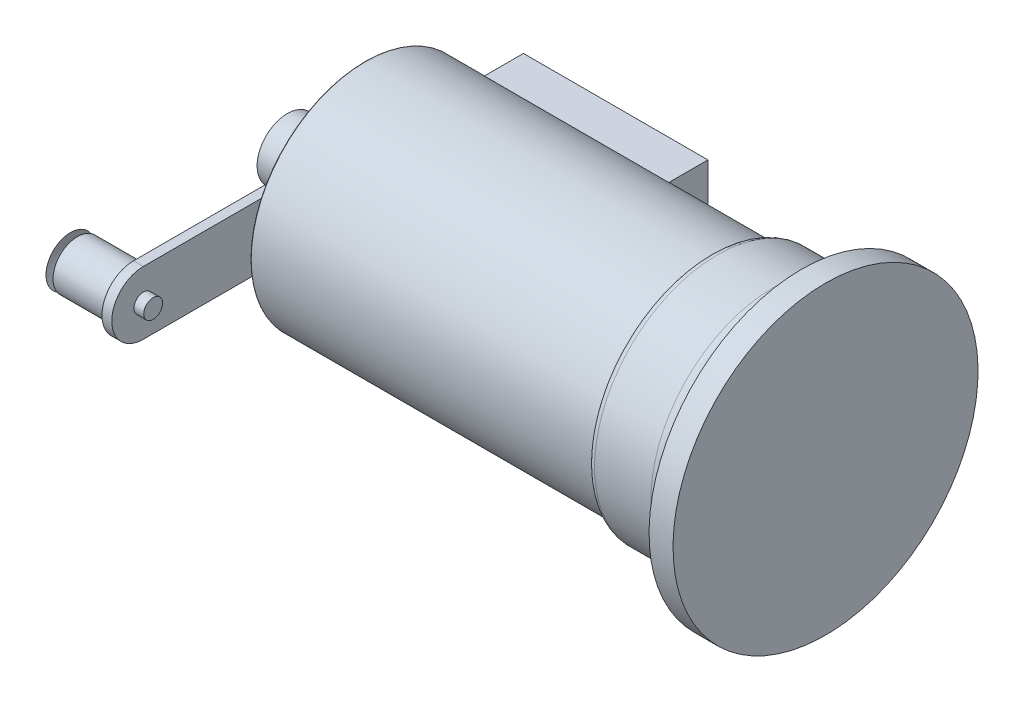
ISO-10303-21;
HEADER;
FILE_DESCRIPTION(('STEP AP214'),'2;1');
FILE_NAME('part.step','',(''),(''),'','','');
FILE_SCHEMA(('AUTOMOTIVE_DESIGN { 1 0 10303 214 1 1 1 1 }'));
ENDSEC;
DATA;
#1=APPLICATION_CONTEXT('core data for automotive mechanical design processes');
#2=APPLICATION_PROTOCOL_DEFINITION('international standard','automotive_design',2000,#1);
#3=PRODUCT_CONTEXT('',#1,'mechanical');
#4=PRODUCT('Part','Part','',(#3));
#5=PRODUCT_RELATED_PRODUCT_CATEGORY('part','',(#4));
#6=PRODUCT_DEFINITION_FORMATION('','',#4);
#7=PRODUCT_DEFINITION_CONTEXT('part definition',#1,'design');
#8=PRODUCT_DEFINITION('design','',#6,#7);
#9=PRODUCT_DEFINITION_SHAPE('','',#8);
#10=(LENGTH_UNIT() NAMED_UNIT(*) SI_UNIT(.MILLI.,.METRE.));
#11=(NAMED_UNIT(*) PLANE_ANGLE_UNIT() SI_UNIT($,.RADIAN.));
#12=(NAMED_UNIT(*) SI_UNIT($,.STERADIAN.) SOLID_ANGLE_UNIT());
#13=UNCERTAINTY_MEASURE_WITH_UNIT(LENGTH_MEASURE(1.E-05),#10,'distance_accuracy_value','');
#14=(GEOMETRIC_REPRESENTATION_CONTEXT(3) GLOBAL_UNCERTAINTY_ASSIGNED_CONTEXT((#13)) GLOBAL_UNIT_ASSIGNED_CONTEXT((#10,
#11,#12)) REPRESENTATION_CONTEXT('',''));
#15=CARTESIAN_POINT('',(0.,0.,0.));
#16=DIRECTION('',(0.,0.,1.));
#17=DIRECTION('',(1.,0.,0.));
#18=AXIS2_PLACEMENT_3D('',#15,#16,#17);
#19=CARTESIAN_POINT('',(-12.9159,-0.0269671132041851,37.2598205131048));
#20=DIRECTION('',(1.,0.,0.));
#21=DIRECTION('',(0.,-1.,0.));
#22=AXIS2_PLACEMENT_3D('',#19,#20,#21);
#23=CONICAL_SURFACE('',#22,4.43287682860842,1.1693705988362);
#24=CARTESIAN_POINT('',(-14.7975445771034,-0.0269671132041851,37.2598205131048));
#25=VERTEX_POINT('',#24);
#26=VERTEX_LOOP('',#25);
#27=FACE_BOUND('',#26,.T.);
#28=CARTESIAN_POINT('',(-12.9159,-0.0269671132041851,37.2598205131048));
#29=DIRECTION('',(-1.,0.,0.));
#30=DIRECTION('',(0.,-1.,0.));
#31=AXIS2_PLACEMENT_3D('',#28,#29,#30);
#32=CIRCLE('',#31,4.43287682860842);
#33=CARTESIAN_POINT('',(-12.9159,-4.45984394181261,37.2598205131048));
#34=VERTEX_POINT('',#33);
#35=EDGE_CURVE('E12',#34,#34,#32,.T.);
#36=ORIENTED_EDGE('',*,*,#35,.T.);
#37=EDGE_LOOP('',(#36));
#38=FACE_BOUND('',#37,.T.);
#39=ADVANCED_FACE('F44',(#27,#38),#23,.T.);
#40=OPEN_SHELL('',(#39));
#41=SHELL_BASED_SURFACE_MODEL('B2',(#40));
#42=CARTESIAN_POINT('',(2.0701,-0.0269671132041848,37.2598205131048));
#43=DIRECTION('',(-1.,0.,0.));
#44=DIRECTION('',(0.,-1.,0.));
#45=AXIS2_PLACEMENT_3D('',#42,#43,#44);
#46=CYLINDRICAL_SURFACE('',#45,1.70950383668605);
#47=CARTESIAN_POINT('',(2.0701,-0.0269671132041848,37.2598205131048));
#48=DIRECTION('',(-1.,0.,0.));
#49=DIRECTION('',(0.,-1.,0.));
#50=AXIS2_PLACEMENT_3D('',#47,#48,#49);
#51=CIRCLE('',#50,1.70950383668605);
#52=CARTESIAN_POINT('',(2.0701,-1.73647094989023,37.2598205131048));
#53=VERTEX_POINT('',#52);
#54=EDGE_CURVE('E43',#53,#53,#51,.T.);
#55=ORIENTED_EDGE('',*,*,#54,.T.);
#56=EDGE_LOOP('',(#55));
#57=FACE_BOUND('',#56,.T.);
#58=CARTESIAN_POINT('',(-12.9159,-0.0269671132041851,37.2598205131048));
#59=DIRECTION('',(-1.,0.,0.));
#60=DIRECTION('',(0.,-1.,0.));
#61=AXIS2_PLACEMENT_3D('',#58,#59,#60);
#62=CIRCLE('',#61,1.70950383668605);
#63=CARTESIAN_POINT('',(-12.9159,-1.73647094989023,37.2598205131048));
#64=VERTEX_POINT('',#63);
#65=EDGE_CURVE('E77',#64,#64,#62,.T.);
#66=ORIENTED_EDGE('',*,*,#65,.F.);
#67=EDGE_LOOP('',(#66));
#68=FACE_BOUND('',#67,.T.);
#69=ADVANCED_FACE('F71',(#57,#68),#46,.T.);
#70=CARTESIAN_POINT('',(2.0701,-0.0269671132041848,37.2598205131048));
#71=DIRECTION('',(-1.,0.,0.));
#72=DIRECTION('',(0.,-1.,0.));
#73=AXIS2_PLACEMENT_3D('',#70,#71,#72);
#74=PLANE('',#73);
#75=ORIENTED_EDGE('',*,*,#54,.F.);
#76=EDGE_LOOP('',(#75));
#77=FACE_BOUND('',#76,.T.);
#78=ADVANCED_FACE('F86',(#77),#74,.F.);
#79=CARTESIAN_POINT('',(-12.9159,-0.0269671132041851,37.2598205131048));
#80=DIRECTION('',(-1.,0.,0.));
#81=DIRECTION('',(0.,-1.,0.));
#82=AXIS2_PLACEMENT_3D('',#79,#80,#81);
#83=PLANE('',#82);
#84=ORIENTED_EDGE('',*,*,#65,.T.);
#85=EDGE_LOOP('',(#84));
#86=FACE_BOUND('',#85,.T.);
#87=ADVANCED_FACE('F83',(#86),#83,.T.);
#88=CLOSED_SHELL('',(#69,#78,#87));
#89=MANIFOLD_SOLID_BREP('B6',#88);
#90=CARTESIAN_POINT('',(-11.6459,-0.0269671132041851,37.2598205131048));
#91=DIRECTION('',(1.,0.,0.));
#92=DIRECTION('',(0.,1.,0.));
#93=AXIS2_PLACEMENT_3D('',#90,#91,#92);
#94=CYLINDRICAL_SURFACE('',#93,4.43287682860842);
#95=CARTESIAN_POINT('',(-11.6459,-0.0269671132041851,37.2598205131048));
#96=DIRECTION('',(-1.,0.,0.));
#97=DIRECTION('',(0.,-1.,0.));
#98=AXIS2_PLACEMENT_3D('',#95,#96,#97);
#99=CIRCLE('',#98,4.43287682860842);
#100=CARTESIAN_POINT('',(-11.6459,-4.45984394181261,37.2598205131048));
#101=VERTEX_POINT('',#100);
#102=EDGE_CURVE('E70',#101,#101,#99,.T.);
#103=ORIENTED_EDGE('',*,*,#102,.F.);
#104=EDGE_LOOP('',(#103));
#105=FACE_BOUND('',#104,.T.);
#106=CARTESIAN_POINT('',(0.292100000000004,-0.0269671132041849,37.2598205131048));
#107=DIRECTION('',(-1.,0.,0.));
#108=DIRECTION('',(0.,-1.,0.));
#109=AXIS2_PLACEMENT_3D('',#106,#107,#108);
#110=CIRCLE('',#109,4.43287682860842);
#111=CARTESIAN_POINT('',(0.292100000000004,-4.45984394181261,37.2598205131048));
#112=VERTEX_POINT('',#111);
#113=EDGE_CURVE('E124',#112,#112,#110,.T.);
#114=ORIENTED_EDGE('',*,*,#113,.T.);
#115=EDGE_LOOP('',(#114));
#116=FACE_BOUND('',#115,.T.);
#117=ADVANCED_FACE('F122',(#105,#116),#94,.T.);
#118=CARTESIAN_POINT('',(-11.6459,-0.0269671132041851,37.2598205131048));
#119=DIRECTION('',(-1.,0.,0.));
#120=DIRECTION('',(0.,-1.,0.));
#121=AXIS2_PLACEMENT_3D('',#118,#119,#120);
#122=PLANE('',#121);
#123=ORIENTED_EDGE('',*,*,#102,.T.);
#124=EDGE_LOOP('',(#123));
#125=FACE_BOUND('',#124,.T.);
#126=ADVANCED_FACE('F136',(#125),#122,.T.);
#127=OPEN_SHELL('',(#117,#126));
#128=SHELL_BASED_SURFACE_MODEL('B38',(#127));
#129=CARTESIAN_POINT('',(0.292100000000004,-0.0269671132041892,-0.316599909176667));
#130=DIRECTION('',(-1.,0.,0.));
#131=DIRECTION('',(0.,-1.,0.));
#132=AXIS2_PLACEMENT_3D('',#129,#130,#131);
#133=PLANE('',#132);
#134=DIRECTION('',(0.,0.,-1.));
#135=VECTOR('',#134,1.);
#136=CARTESIAN_POINT('',(0.292100000000004,5.68803288679581,-1.98080117287673));
#137=LINE('',#136,#135);
#138=CARTESIAN_POINT('',(0.292100000000004,5.68803288679581,37.2598205131048));
#139=VERTEX_POINT('',#138);
#140=CARTESIAN_POINT('',(0.292100000000004,5.68803288679581,-1.98080117287673));
#141=VERTEX_POINT('',#140);
#142=EDGE_CURVE('E173',#139,#141,#137,.T.);
#143=ORIENTED_EDGE('',*,*,#142,.T.);
#144=CARTESIAN_POINT('',(0.292100000000004,-0.0269671132041892,-0.316599909176667));
#145=DIRECTION('',(-1.,0.,0.));
#146=DIRECTION('',(0.,1.,0.));
#147=AXIS2_PLACEMENT_3D('',#144,#145,#146);
#148=CIRCLE('',#147,5.95237690726157);
#149=CARTESIAN_POINT('',(0.292100000000004,-5.74196711320419,-1.98080117287673));
#150=VERTEX_POINT('',#149);
#151=EDGE_CURVE('E184',#141,#150,#148,.T.);
#152=ORIENTED_EDGE('',*,*,#151,.T.);
#153=DIRECTION('',(0.,0.,1.));
#154=VECTOR('',#153,1.);
#155=CARTESIAN_POINT('',(0.292100000000004,-5.74196711320419,-1.98080117287673));
#156=LINE('',#155,#154);
#157=CARTESIAN_POINT('',(0.292100000000004,-5.74196711320418,37.2598205131048));
#158=VERTEX_POINT('',#157);
#159=EDGE_CURVE('E169',#150,#158,#156,.T.);
#160=ORIENTED_EDGE('',*,*,#159,.T.);
#161=CARTESIAN_POINT('',(0.292100000000004,-0.0269671132041849,37.2598205131048));
#162=DIRECTION('',(-1.,0.,0.));
#163=DIRECTION('',(0.,1.,0.));
#164=AXIS2_PLACEMENT_3D('',#161,#162,#163);
#165=CIRCLE('',#164,5.71499999999999);
#166=EDGE_CURVE('E120',#158,#139,#165,.T.);
#167=ORIENTED_EDGE('',*,*,#166,.T.);
#168=EDGE_LOOP('',(#143,#152,#160,#167));
#169=FACE_BOUND('',#168,.T.);
#170=ADVANCED_FACE('F164',(#169),#133,.T.);
#171=OPEN_SHELL('',(#170));
#172=SHELL_BASED_SURFACE_MODEL('B65',(#171));
#173=CARTESIAN_POINT('',(-1.4859,-0.0269671132041892,-0.316599909176667));
#174=DIRECTION('',(-1.,0.,0.));
#175=DIRECTION('',(0.,-1.,0.));
#176=AXIS2_PLACEMENT_3D('',#173,#174,#175);
#177=PLANE('',#176);
#178=CARTESIAN_POINT('',(-1.4859,-0.0269671132041892,-0.316599909176667));
#179=DIRECTION('',(-1.,0.,0.));
#180=DIRECTION('',(0.,1.,0.));
#181=AXIS2_PLACEMENT_3D('',#178,#179,#180);
#182=CIRCLE('',#181,5.95237690726157);
#183=CARTESIAN_POINT('',(-1.4859,5.68803288679581,-1.98080117287673));
#184=VERTEX_POINT('',#183);
#185=CARTESIAN_POINT('',(-1.4859,-5.74196711320419,-1.98080117287673));
#186=VERTEX_POINT('',#185);
#187=EDGE_CURVE('E227',#184,#186,#182,.T.);
#188=ORIENTED_EDGE('',*,*,#187,.T.);
#189=DIRECTION('',(0.,0.,1.));
#190=VECTOR('',#189,1.);
#191=CARTESIAN_POINT('',(-1.4859,-5.74196711320419,-1.98080117287673));
#192=LINE('',#191,#190);
#193=CARTESIAN_POINT('',(-1.4859,-5.74196711320418,37.2598205131048));
#194=VERTEX_POINT('',#193);
#195=EDGE_CURVE('E238',#186,#194,#192,.T.);
#196=ORIENTED_EDGE('',*,*,#195,.T.);
#197=CARTESIAN_POINT('',(-1.4859,-0.0269671132041849,37.2598205131048));
#198=DIRECTION('',(-1.,0.,0.));
#199=DIRECTION('',(0.,1.,0.));
#200=AXIS2_PLACEMENT_3D('',#197,#198,#199);
#201=CIRCLE('',#200,5.71499999999999);
#202=CARTESIAN_POINT('',(-1.4859,5.68803288679581,37.2598205131048));
#203=VERTEX_POINT('',#202);
#204=EDGE_CURVE('E223',#194,#203,#201,.T.);
#205=ORIENTED_EDGE('',*,*,#204,.T.);
#206=DIRECTION('',(0.,0.,-1.));
#207=VECTOR('',#206,1.);
#208=CARTESIAN_POINT('',(-1.4859,5.68803288679581,-1.98080117287673));
#209=LINE('',#208,#207);
#210=EDGE_CURVE('E162',#203,#184,#209,.T.);
#211=ORIENTED_EDGE('',*,*,#210,.T.);
#212=EDGE_LOOP('',(#188,#196,#205,#211));
#213=FACE_BOUND('',#212,.T.);
#214=ADVANCED_FACE('F218',(#213),#177,.T.);
#215=OPEN_SHELL('',(#214));
#216=SHELL_BASED_SURFACE_MODEL('B114',(#215));
#217=CARTESIAN_POINT('',(0.292100000000004,-0.0269671132041892,-0.316599909176667));
#218=DIRECTION('',(-1.,0.,0.));
#219=DIRECTION('',(0.,-1.,0.));
#220=AXIS2_PLACEMENT_3D('',#217,#218,#219);
#221=CYLINDRICAL_SURFACE('',#220,5.95237690726157);
#222=CARTESIAN_POINT('',(-1.4859,-0.0269671132041892,-0.316599909176667));
#223=DIRECTION('',(-1.,0.,0.));
#224=DIRECTION('',(0.,1.,0.));
#225=AXIS2_PLACEMENT_3D('',#222,#223,#224);
#226=CIRCLE('',#225,5.95237690726157);
#227=CARTESIAN_POINT('',(-1.4859,5.68803288679581,-1.98080117287673));
#228=VERTEX_POINT('',#227);
#229=CARTESIAN_POINT('',(-1.4859,-5.74196711320419,-1.98080117287673));
#230=VERTEX_POINT('',#229);
#231=EDGE_CURVE('E280',#228,#230,#226,.T.);
#232=ORIENTED_EDGE('',*,*,#231,.F.);
#233=DIRECTION('',(-1.,0.,0.));
#234=VECTOR('',#233,1.);
#235=CARTESIAN_POINT('',(0.292100000000004,5.68803288679581,-1.98080117287673));
#236=LINE('',#235,#234);
#237=CARTESIAN_POINT('',(0.292100000000004,5.68803288679581,-1.98080117287673));
#238=VERTEX_POINT('',#237);
#239=EDGE_CURVE('E288',#238,#228,#236,.T.);
#240=ORIENTED_EDGE('',*,*,#239,.F.);
#241=CARTESIAN_POINT('',(0.292100000000004,-0.0269671132041892,-0.316599909176667));
#242=DIRECTION('',(-1.,0.,0.));
#243=DIRECTION('',(0.,1.,0.));
#244=AXIS2_PLACEMENT_3D('',#241,#242,#243);
#245=CIRCLE('',#244,5.95237690726157);
#246=CARTESIAN_POINT('',(0.292100000000004,-5.74196711320419,-1.98080117287673));
#247=VERTEX_POINT('',#246);
#248=EDGE_CURVE('E216',#238,#247,#245,.T.);
#249=ORIENTED_EDGE('',*,*,#248,.T.);
#250=DIRECTION('',(-1.,0.,0.));
#251=VECTOR('',#250,1.);
#252=CARTESIAN_POINT('',(0.292100000000004,-5.74196711320419,-1.98080117287673));
#253=LINE('',#252,#251);
#254=EDGE_CURVE('E274',#247,#230,#253,.T.);
#255=ORIENTED_EDGE('',*,*,#254,.T.);
#256=EDGE_LOOP('',(#232,#240,#249,#255));
#257=FACE_BOUND('',#256,.T.);
#258=ADVANCED_FACE('F272',(#257),#221,.T.);
#259=CARTESIAN_POINT('',(0.292100000000004,-5.74196711320419,-1.98080117287673));
#260=DIRECTION('',(0.,-1.,0.));
#261=DIRECTION('',(0.,0.,-1.));
#262=AXIS2_PLACEMENT_3D('',#259,#260,#261);
#263=PLANE('',#262);
#264=DIRECTION('',(0.,0.,1.));
#265=VECTOR('',#264,1.);
#266=CARTESIAN_POINT('',(-1.4859,-5.74196711320419,-1.98080117287673));
#267=LINE('',#266,#265);
#268=CARTESIAN_POINT('',(-1.4859,-5.74196711320418,37.2598205131048));
#269=VERTEX_POINT('',#268);
#270=EDGE_CURVE('E325',#230,#269,#267,.T.);
#271=ORIENTED_EDGE('',*,*,#270,.F.);
#272=ORIENTED_EDGE('',*,*,#254,.F.);
#273=DIRECTION('',(0.,0.,1.));
#274=VECTOR('',#273,1.);
#275=CARTESIAN_POINT('',(0.292100000000004,-5.74196711320419,-1.98080117287673));
#276=LINE('',#275,#274);
#277=CARTESIAN_POINT('',(0.292100000000004,-5.74196711320418,37.2598205131048));
#278=VERTEX_POINT('',#277);
#279=EDGE_CURVE('E327',#247,#278,#276,.T.);
#280=ORIENTED_EDGE('',*,*,#279,.T.);
#281=DIRECTION('',(-1.,0.,0.));
#282=VECTOR('',#281,1.);
#283=CARTESIAN_POINT('',(0.292100000000004,-5.74196711320418,37.2598205131048));
#284=LINE('',#283,#282);
#285=EDGE_CURVE('E317',#278,#269,#284,.T.);
#286=ORIENTED_EDGE('',*,*,#285,.T.);
#287=EDGE_LOOP('',(#271,#272,#280,#286));
#288=FACE_BOUND('',#287,.T.);
#289=ADVANCED_FACE('F328',(#288),#263,.T.);
#290=CARTESIAN_POINT('',(0.292100000000004,-0.0269671132041849,37.2598205131048));
#291=DIRECTION('',(-1.,0.,0.));
#292=DIRECTION('',(0.,-1.,0.));
#293=AXIS2_PLACEMENT_3D('',#290,#291,#292);
#294=CYLINDRICAL_SURFACE('',#293,5.71499999999999);
#295=CARTESIAN_POINT('',(-1.4859,-0.0269671132041849,37.2598205131048));
#296=DIRECTION('',(-1.,0.,0.));
#297=DIRECTION('',(0.,1.,0.));
#298=AXIS2_PLACEMENT_3D('',#295,#296,#297);
#299=CIRCLE('',#298,5.71499999999999);
#300=CARTESIAN_POINT('',(-1.4859,5.68803288679581,37.2598205131048));
#301=VERTEX_POINT('',#300);
#302=EDGE_CURVE('E322',#269,#301,#299,.T.);
#303=ORIENTED_EDGE('',*,*,#302,.F.);
#304=ORIENTED_EDGE('',*,*,#285,.F.);
#305=CARTESIAN_POINT('',(0.292100000000004,-0.0269671132041849,37.2598205131048));
#306=DIRECTION('',(-1.,0.,0.));
#307=DIRECTION('',(0.,1.,0.));
#308=AXIS2_PLACEMENT_3D('',#305,#306,#307);
#309=CIRCLE('',#308,5.71499999999999);
#310=CARTESIAN_POINT('',(0.292100000000004,5.68803288679581,37.2598205131048));
#311=VERTEX_POINT('',#310);
#312=EDGE_CURVE('E320',#278,#311,#309,.T.);
#313=ORIENTED_EDGE('',*,*,#312,.T.);
#314=DIRECTION('',(-1.,0.,0.));
#315=VECTOR('',#314,1.);
#316=CARTESIAN_POINT('',(0.292100000000004,5.68803288679581,37.2598205131048));
#317=LINE('',#316,#315);
#318=EDGE_CURVE('E305',#311,#301,#317,.T.);
#319=ORIENTED_EDGE('',*,*,#318,.T.);
#320=EDGE_LOOP('',(#303,#304,#313,#319));
#321=FACE_BOUND('',#320,.T.);
#322=ADVANCED_FACE('F319',(#321),#294,.T.);
#323=CARTESIAN_POINT('',(0.292100000000004,5.68803288679581,-1.98080117287673));
#324=DIRECTION('',(0.,1.,0.));
#325=DIRECTION('',(-1.,0.,0.));
#326=AXIS2_PLACEMENT_3D('',#323,#324,#325);
#327=PLANE('',#326);
#328=DIRECTION('',(0.,0.,-1.));
#329=VECTOR('',#328,1.);
#330=CARTESIAN_POINT('',(-1.4859,5.68803288679581,-1.98080117287673));
#331=LINE('',#330,#329);
#332=EDGE_CURVE('E344',#301,#228,#331,.T.);
#333=ORIENTED_EDGE('',*,*,#332,.F.);
#334=ORIENTED_EDGE('',*,*,#318,.F.);
#335=DIRECTION('',(0.,0.,-1.));
#336=VECTOR('',#335,1.);
#337=CARTESIAN_POINT('',(0.292100000000004,5.68803288679581,-1.98080117287673));
#338=LINE('',#337,#336);
#339=EDGE_CURVE('E338',#311,#238,#338,.T.);
#340=ORIENTED_EDGE('',*,*,#339,.T.);
#341=ORIENTED_EDGE('',*,*,#239,.T.);
#342=EDGE_LOOP('',(#333,#334,#340,#341));
#343=FACE_BOUND('',#342,.T.);
#344=ADVANCED_FACE('F358',(#343),#327,.T.);
#345=OPEN_SHELL('',(#258,#289,#322,#344));
#346=SHELL_BASED_SURFACE_MODEL('B156',(#345));
#347=CARTESIAN_POINT('',(0.,0.,-20.73275));
#348=DIRECTION('',(0.,0.,1.));
#349=DIRECTION('',(1.,0.,0.));
#350=AXIS2_PLACEMENT_3D('',#347,#348,#349);
#351=PLANE('',#350);
#352=DIRECTION('',(-1.,0.,0.));
#353=VECTOR('',#352,1.);
#354=CARTESIAN_POINT('',(44.6077146277967,15.5702,-20.73275));
#355=LINE('',#354,#353);
#356=CARTESIAN_POINT('',(44.6077146277967,15.5702,-20.73275));
#357=VERTEX_POINT('',#356);
#358=CARTESIAN_POINT('',(11.1813146277967,15.5702,-20.73275));
#359=VERTEX_POINT('',#358);
#360=EDGE_CURVE('E417',#357,#359,#355,.T.);
#361=ORIENTED_EDGE('',*,*,#360,.T.);
#362=DIRECTION('',(0.,-1.,0.));
#363=VECTOR('',#362,1.);
#364=CARTESIAN_POINT('',(11.1813146277967,15.5702,-20.73275));
#365=LINE('',#364,#363);
#366=CARTESIAN_POINT('',(11.1813146277967,-15.5702,-20.73275));
#367=VERTEX_POINT('',#366);
#368=EDGE_CURVE('E428',#359,#367,#365,.T.);
#369=ORIENTED_EDGE('',*,*,#368,.T.);
#370=DIRECTION('',(1.,0.,0.));
#371=VECTOR('',#370,1.);
#372=CARTESIAN_POINT('',(11.1813146277967,-15.5702,-20.73275));
#373=LINE('',#372,#371);
#374=CARTESIAN_POINT('',(44.6077146277967,-15.5702,-20.73275));
#375=VERTEX_POINT('',#374);
#376=EDGE_CURVE('E413',#367,#375,#373,.T.);
#377=ORIENTED_EDGE('',*,*,#376,.T.);
#378=DIRECTION('',(0.,1.,0.));
#379=VECTOR('',#378,1.);
#380=CARTESIAN_POINT('',(44.6077146277967,-15.5702,-20.73275));
#381=LINE('',#380,#379);
#382=EDGE_CURVE('E270',#375,#357,#381,.T.);
#383=ORIENTED_EDGE('',*,*,#382,.T.);
#384=EDGE_LOOP('',(#361,#369,#377,#383));
#385=FACE_BOUND('',#384,.T.);
#386=ADVANCED_FACE('F408',(#385),#351,.T.);
#387=OPEN_SHELL('',(#386));
#388=SHELL_BASED_SURFACE_MODEL('B210',(#387));
#389=CARTESIAN_POINT('',(44.6077146277967,15.5702,-20.73275));
#390=DIRECTION('',(-1.,0.,0.));
#391=DIRECTION('',(0.,-1.,0.));
#392=AXIS2_PLACEMENT_3D('',#389,#390,#391);
#393=PLANE('',#392);
#394=DIRECTION('',(0.,-1.,0.));
#395=VECTOR('',#394,1.);
#396=CARTESIAN_POINT('',(44.6077146277967,15.5702,2.12725));
#397=LINE('',#396,#395);
#398=CARTESIAN_POINT('',(44.6077146277967,15.5702,2.12725));
#399=VERTEX_POINT('',#398);
#400=CARTESIAN_POINT('',(44.6077146277967,-15.5702,2.12725));
#401=VERTEX_POINT('',#400);
#402=EDGE_CURVE('E490',#399,#401,#397,.T.);
#403=ORIENTED_EDGE('',*,*,#402,.T.);
#404=DIRECTION('',(0.,0.,1.));
#405=VECTOR('',#404,1.);
#406=CARTESIAN_POINT('',(44.6077146277967,-15.5702,-20.73275));
#407=LINE('',#406,#405);
#408=CARTESIAN_POINT('',(44.6077146277967,-15.5702,-20.73275));
#409=VERTEX_POINT('',#408);
#410=EDGE_CURVE('E496',#409,#401,#407,.T.);
#411=ORIENTED_EDGE('',*,*,#410,.F.);
#412=DIRECTION('',(0.,-1.,0.));
#413=VECTOR('',#412,1.);
#414=CARTESIAN_POINT('',(44.6077146277967,15.5702,-20.73275));
#415=LINE('',#414,#413);
#416=CARTESIAN_POINT('',(44.6077146277967,15.5702,-20.73275));
#417=VERTEX_POINT('',#416);
#418=EDGE_CURVE('E476',#417,#409,#415,.T.);
#419=ORIENTED_EDGE('',*,*,#418,.F.);
#420=DIRECTION('',(0.,0.,1.));
#421=VECTOR('',#420,1.);
#422=CARTESIAN_POINT('',(44.6077146277967,15.5702,-20.73275));
#423=LINE('',#422,#421);
#424=EDGE_CURVE('E524',#417,#399,#423,.T.);
#425=ORIENTED_EDGE('',*,*,#424,.T.);
#426=EDGE_LOOP('',(#403,#411,#419,#425));
#427=FACE_BOUND('',#426,.T.);
#428=ADVANCED_FACE('F461',(#427),#393,.F.);
#429=CARTESIAN_POINT('',(11.1813146277967,15.5702,-20.73275));
#430=DIRECTION('',(0.,-1.,0.));
#431=DIRECTION('',(0.,0.,-1.));
#432=AXIS2_PLACEMENT_3D('',#429,#430,#431);
#433=PLANE('',#432);
#434=DIRECTION('',(1.,0.,0.));
#435=VECTOR('',#434,1.);
#436=CARTESIAN_POINT('',(11.1813146277967,15.5702,2.12725));
#437=LINE('',#436,#435);
#438=CARTESIAN_POINT('',(11.1813146277967,15.5702,2.12725));
#439=VERTEX_POINT('',#438);
#440=EDGE_CURVE('E508',#439,#399,#437,.T.);
#441=ORIENTED_EDGE('',*,*,#440,.T.);
#442=ORIENTED_EDGE('',*,*,#424,.F.);
#443=DIRECTION('',(1.,0.,0.));
#444=VECTOR('',#443,1.);
#445=CARTESIAN_POINT('',(11.1813146277967,15.5702,-20.73275));
#446=LINE('',#445,#444);
#447=CARTESIAN_POINT('',(11.1813146277967,15.5702,-20.73275));
#448=VERTEX_POINT('',#447);
#449=EDGE_CURVE('E520',#448,#417,#446,.T.);
#450=ORIENTED_EDGE('',*,*,#449,.F.);
#451=DIRECTION('',(0.,0.,1.));
#452=VECTOR('',#451,1.);
#453=CARTESIAN_POINT('',(11.1813146277967,15.5702,-20.73275));
#454=LINE('',#453,#452);
#455=EDGE_CURVE('E464',#448,#439,#454,.T.);
#456=ORIENTED_EDGE('',*,*,#455,.T.);
#457=EDGE_LOOP('',(#441,#442,#450,#456));
#458=FACE_BOUND('',#457,.T.);
#459=ADVANCED_FACE('F539',(#458),#433,.F.);
#460=CARTESIAN_POINT('',(11.1813146277967,-15.5702,-20.73275));
#461=DIRECTION('',(0.,-1.,0.));
#462=DIRECTION('',(1.,0.,0.));
#463=AXIS2_PLACEMENT_3D('',#460,#461,#462);
#464=PLANE('',#463);
#465=DIRECTION('',(1.,0.,0.));
#466=VECTOR('',#465,1.);
#467=CARTESIAN_POINT('',(11.1813146277967,-15.5702,2.12725));
#468=LINE('',#467,#466);
#469=CARTESIAN_POINT('',(11.1813146277967,-15.5702,2.12725));
#470=VERTEX_POINT('',#469);
#471=EDGE_CURVE('E470',#470,#401,#468,.T.);
#472=ORIENTED_EDGE('',*,*,#471,.F.);
#473=DIRECTION('',(0.,0.,1.));
#474=VECTOR('',#473,1.);
#475=CARTESIAN_POINT('',(11.1813146277967,-15.5702,-20.73275));
#476=LINE('',#475,#474);
#477=CARTESIAN_POINT('',(11.1813146277967,-15.5702,-20.73275));
#478=VERTEX_POINT('',#477);
#479=EDGE_CURVE('E504',#478,#470,#476,.T.);
#480=ORIENTED_EDGE('',*,*,#479,.F.);
#481=DIRECTION('',(1.,0.,0.));
#482=VECTOR('',#481,1.);
#483=CARTESIAN_POINT('',(11.1813146277967,-15.5702,-20.73275));
#484=LINE('',#483,#482);
#485=EDGE_CURVE('E406',#478,#409,#484,.T.);
#486=ORIENTED_EDGE('',*,*,#485,.T.);
#487=ORIENTED_EDGE('',*,*,#410,.T.);
#488=EDGE_LOOP('',(#472,#480,#486,#487));
#489=FACE_BOUND('',#488,.T.);
#490=ADVANCED_FACE('F462',(#489),#464,.T.);
#491=CARTESIAN_POINT('',(11.1813146277967,15.5702,-20.73275));
#492=DIRECTION('',(-1.,0.,0.));
#493=DIRECTION('',(0.,-1.,0.));
#494=AXIS2_PLACEMENT_3D('',#491,#492,#493);
#495=PLANE('',#494);
#496=DIRECTION('',(0.,-1.,0.));
#497=VECTOR('',#496,1.);
#498=CARTESIAN_POINT('',(11.1813146277967,15.5702,2.12725));
#499=LINE('',#498,#497);
#500=EDGE_CURVE('E518',#439,#470,#499,.T.);
#501=ORIENTED_EDGE('',*,*,#500,.F.);
#502=ORIENTED_EDGE('',*,*,#455,.F.);
#503=DIRECTION('',(0.,-1.,0.));
#504=VECTOR('',#503,1.);
#505=CARTESIAN_POINT('',(11.1813146277967,15.5702,-20.73275));
#506=LINE('',#505,#504);
#507=EDGE_CURVE('E509',#448,#478,#506,.T.);
#508=ORIENTED_EDGE('',*,*,#507,.T.);
#509=ORIENTED_EDGE('',*,*,#479,.T.);
#510=EDGE_LOOP('',(#501,#502,#508,#509));
#511=FACE_BOUND('',#510,.T.);
#512=ADVANCED_FACE('F511',(#511),#495,.T.);
#513=OPEN_SHELL('',(#428,#459,#490,#512));
#514=SHELL_BASED_SURFACE_MODEL('B264',(#513));
#515=CARTESIAN_POINT('',(-12.6619,0.,0.));
#516=DIRECTION('',(1.,0.,0.));
#517=DIRECTION('',(0.,1.,0.));
#518=AXIS2_PLACEMENT_3D('',#515,#516,#517);
#519=CONICAL_SURFACE('',#518,0.,1.25436121483771);
#520=CARTESIAN_POINT('',(-10.865445930767,0.,0.));
#521=DIRECTION('',(1.,0.,0.));
#522=DIRECTION('',(0.,1.,0.));
#523=AXIS2_PLACEMENT_3D('',#520,#521,#522);
#524=CIRCLE('',#523,5.4864);
#525=CARTESIAN_POINT('',(-10.865445930767,5.4864,0.));
#526=VERTEX_POINT('',#525);
#527=EDGE_CURVE('E646',#526,#526,#524,.T.);
#528=ORIENTED_EDGE('',*,*,#527,.T.);
#529=EDGE_LOOP('',(#528));
#530=FACE_BOUND('',#529,.T.);
#531=CARTESIAN_POINT('',(-12.6619,0.,0.));
#532=VERTEX_POINT('',#531);
#533=VERTEX_LOOP('',#532);
#534=FACE_BOUND('',#533,.T.);
#535=ADVANCED_FACE('F587',(#530,#534),#519,.F.);
#536=CARTESIAN_POINT('',(-12.6619,0.,0.));
#537=DIRECTION('',(1.,0.,0.));
#538=DIRECTION('',(0.,1.,0.));
#539=AXIS2_PLACEMENT_3D('',#536,#537,#538);
#540=CYLINDRICAL_SURFACE('',#539,5.4864);
#541=CARTESIAN_POINT('',(0.847159604505099,0.,0.));
#542=DIRECTION('',(1.,0.,0.));
#543=DIRECTION('',(0.,1.,0.));
#544=AXIS2_PLACEMENT_3D('',#541,#542,#543);
#545=CIRCLE('',#544,5.4864);
#546=CARTESIAN_POINT('',(0.847159604505099,5.4864,0.));
#547=VERTEX_POINT('',#546);
#548=EDGE_CURVE('E643',#547,#547,#545,.T.);
#549=ORIENTED_EDGE('',*,*,#548,.T.);
#550=EDGE_LOOP('',(#549));
#551=FACE_BOUND('',#550,.T.);
#552=ORIENTED_EDGE('',*,*,#527,.F.);
#553=EDGE_LOOP('',(#552));
#554=FACE_BOUND('',#553,.T.);
#555=ADVANCED_FACE('F597',(#551,#554),#540,.F.);
#556=CARTESIAN_POINT('',(0.847159604505099,0.,0.));
#557=DIRECTION('',(1.,0.,0.));
#558=DIRECTION('',(0.,1.,0.));
#559=AXIS2_PLACEMENT_3D('',#556,#557,#558);
#560=CONICAL_SURFACE('',#559,5.4864,1.417595420437);
#561=CARTESIAN_POINT('',(3.18180209295581,0.,0.));
#562=DIRECTION('',(1.,0.,0.));
#563=DIRECTION('',(0.,1.,0.));
#564=AXIS2_PLACEMENT_3D('',#561,#562,#563);
#565=CIRCLE('',#564,20.6060804952931);
#566=CARTESIAN_POINT('',(3.18180209295581,20.6060804952931,0.));
#567=VERTEX_POINT('',#566);
#568=EDGE_CURVE('E640',#567,#567,#565,.T.);
#569=CARTESIAN_POINT('',(3.18180209295581,20.6060804952931,0.));
#570=CARTESIAN_POINT('',(3.15748290036779,20.4485838234672,0.));
#571=CARTESIAN_POINT('',(3.13316370777976,20.2910871516412,0.));
#572=CARTESIAN_POINT('',(3.0845253226037,19.9760938079892,0.));
#573=CARTESIAN_POINT('',(3.06020613001567,19.8185971361633,0.));
#574=CARTESIAN_POINT('',(3.01156774483962,19.5036037925113,0.));
#575=CARTESIAN_POINT('',(2.98724855225159,19.3461071206854,0.));
#576=CARTESIAN_POINT('',(2.93861016707553,19.0311137770334,0.));
#577=CARTESIAN_POINT('',(2.9142909744875,18.8736171052075,0.));
#578=CARTESIAN_POINT('',(2.86565258931145,18.5586237615555,0.));
#579=CARTESIAN_POINT('',(2.84133339672342,18.4011270897295,0.));
#580=CARTESIAN_POINT('',(2.79269501154736,18.0861337460776,0.));
#581=CARTESIAN_POINT('',(2.76837581895933,17.9286370742516,0.));
#582=CARTESIAN_POINT('',(2.71973743378328,17.6136437305997,0.));
#583=CARTESIAN_POINT('',(2.69541824119525,17.4561470587737,0.));
#584=CARTESIAN_POINT('',(2.64677985601919,17.1411537151218,0.));
#585=CARTESIAN_POINT('',(2.62246066343116,16.9836570432958,0.));
#586=CARTESIAN_POINT('',(2.57382227825511,16.6686636996439,0.));
#587=CARTESIAN_POINT('',(2.54950308566708,16.5111670278179,0.));
#588=CARTESIAN_POINT('',(2.50086470049102,16.196173684166,0.));
#589=CARTESIAN_POINT('',(2.47654550790299,16.03867701234,0.));
#590=CARTESIAN_POINT('',(2.42790712272694,15.7236836686881,0.));
#591=CARTESIAN_POINT('',(2.40358793013891,15.5661869968621,0.));
#592=CARTESIAN_POINT('',(2.35494954496285,15.2511936532101,0.));
#593=CARTESIAN_POINT('',(2.33063035237482,15.0936969813842,0.));
#594=CARTESIAN_POINT('',(2.28199196719877,14.7787036377322,0.));
#595=CARTESIAN_POINT('',(2.25767277461074,14.6212069659063,0.));
#596=CARTESIAN_POINT('',(2.20903438943468,14.3062136222543,0.));
#597=CARTESIAN_POINT('',(2.18471519684665,14.1487169504284,0.));
#598=CARTESIAN_POINT('',(2.1360768116706,13.8337236067764,0.));
#599=CARTESIAN_POINT('',(2.11175761908257,13.6762269349504,0.));
#600=CARTESIAN_POINT('',(2.06311923390651,13.3612335912985,0.));
#601=CARTESIAN_POINT('',(2.03880004131848,13.2037369194725,0.));
#602=CARTESIAN_POINT('',(1.99016165614243,12.8887435758206,0.));
#603=CARTESIAN_POINT('',(1.9658424635544,12.7312469039946,0.));
#604=CARTESIAN_POINT('',(1.91720407837834,12.4162535603427,0.));
#605=CARTESIAN_POINT('',(1.89288488579031,12.2587568885167,0.));
#606=CARTESIAN_POINT('',(1.84424650061426,11.9437635448648,0.));
#607=CARTESIAN_POINT('',(1.81992730802623,11.7862668730388,0.));
#608=CARTESIAN_POINT('',(1.77128892285017,11.4712735293869,0.));
#609=CARTESIAN_POINT('',(1.74696973026215,11.3137768575609,0.));
#610=CARTESIAN_POINT('',(1.69833134508609,10.998783513909,0.));
#611=CARTESIAN_POINT('',(1.67401215249806,10.841286842083,0.));
#612=CARTESIAN_POINT('',(1.625373767322,10.526293498431,0.));
#613=CARTESIAN_POINT('',(1.60105457473398,10.3687968266051,0.));
#614=CARTESIAN_POINT('',(1.55241618955792,10.0538034829531,0.));
#615=CARTESIAN_POINT('',(1.52809699696989,9.89630681112716,0.));
#616=CARTESIAN_POINT('',(1.47945861179383,9.58131346747522,0.));
#617=CARTESIAN_POINT('',(1.45513941920581,9.42381679564925,0.));
#618=CARTESIAN_POINT('',(1.40650103402975,9.10882345199731,0.));
#619=CARTESIAN_POINT('',(1.38218184144172,8.95132678017134,0.));
#620=CARTESIAN_POINT('',(1.33354345626566,8.6363334365194,0.));
#621=CARTESIAN_POINT('',(1.30922426367764,8.47883676469343,0.));
#622=CARTESIAN_POINT('',(1.26058587850158,8.16384342104149,0.));
#623=CARTESIAN_POINT('',(1.23626668591355,8.00634674921552,0.));
#624=CARTESIAN_POINT('',(1.18762830073749,7.69135340556358,0.));
#625=CARTESIAN_POINT('',(1.16330910814947,7.53385673373761,0.));
#626=CARTESIAN_POINT('',(1.11467072297341,7.21886339008567,0.));
#627=CARTESIAN_POINT('',(1.09035153038538,7.0613667182597,0.));
#628=CARTESIAN_POINT('',(1.04171314520932,6.74637337460776,0.));
#629=CARTESIAN_POINT('',(1.0173939526213,6.58887670278179,0.));
#630=CARTESIAN_POINT('',(0.96875556744524,6.27388335912985,0.));
#631=CARTESIAN_POINT('',(0.944436374857212,6.11638668730388,0.));
#632=CARTESIAN_POINT('',(0.895797989681155,5.80139334365194,0.));
#633=CARTESIAN_POINT('',(0.871478797093127,5.64389667182597,0.));
#634=CARTESIAN_POINT('',(0.847159604505099,5.4864,0.));
#635=B_SPLINE_CURVE_WITH_KNOTS('',3,(#569,#570,#571,#572,#573,#574,#575,#576,#577,#578,#579,
#580,#581,#582,#583,#584,#585,#586,#587,#588,#589,#590,#591,#592,#593,#594,#595,#596,#597,#598,
#599,#600,#601,#602,#603,#604,#605,#606,#607,#608,#609,#610,#611,#612,#613,#614,#615,#616,#617,
#618,#619,#620,#621,#622,#623,#624,#625,#626,#627,#628,#629,#630,#631,#632,#633,#634),
.UNSPECIFIED.,.F.,.F.,(4,2,2,2,2,2,2,2,2,2,2,2,2,2,2,2,2,2,2,2,2,2,2,2,2,2,2,2,2,2,2,2,4),(0.,
0.478089555292232,0.956179110584454,1.43426866587668,1.91235822116891,2.39044777646113,
2.86853733175336,3.34662688704558,3.82471644233781,4.30280599763004,4.78089555292226,
5.25898510821449,5.73707466350672,6.21516421879894,6.69325377409117,7.1713433293834,
7.64943288467562,8.12752243996785,8.60561199526007,9.0837015505523,9.56179110584453,
10.0398806611368,10.517970216429,10.9960597717212,11.4741493270134,11.9522388823057,
12.4303284375979,12.9084179928901,13.3865075481823,13.8645971034746,14.3426866587668,
14.820776214059,15.2988657693512),.UNSPECIFIED.);
#636=EDGE_CURVE('BSEAM604',#567,#547,#635,.T.);
#637=ORIENTED_EDGE('',*,*,#568,.T.);
#638=ORIENTED_EDGE('',*,*,#548,.F.);
#639=ORIENTED_EDGE('',*,*,#636,.T.);
#640=ORIENTED_EDGE('',*,*,#636,.F.);
#641=EDGE_LOOP('',(#637,#639,#638,#640));
#642=FACE_BOUND('',#641,.T.);
#643=ADVANCED_FACE('F604',(#642),#560,.F.);
#644=CARTESIAN_POINT('',(3.30731462779673,0.,0.));
#645=DIRECTION('',(1.,0.,0.));
#646=DIRECTION('',(0.,1.,0.));
#647=AXIS2_PLACEMENT_3D('',#644,#645,#646);
#648=TOROIDAL_SURFACE('',#647,20.5867,0.126999999999999);
#649=CARTESIAN_POINT('',(3.30731462779673,0.,0.));
#650=DIRECTION('',(1.,0.,0.));
#651=DIRECTION('',(0.,1.,0.));
#652=AXIS2_PLACEMENT_3D('',#649,#650,#651);
#653=CIRCLE('',#652,20.7137);
#654=CARTESIAN_POINT('',(3.30731462779673,20.7137,0.));
#655=VERTEX_POINT('',#654);
#656=EDGE_CURVE('E637',#655,#655,#653,.T.);
#657=ORIENTED_EDGE('',*,*,#656,.T.);
#658=EDGE_LOOP('',(#657));
#659=FACE_BOUND('',#658,.T.);
#660=ORIENTED_EDGE('',*,*,#568,.F.);
#661=EDGE_LOOP('',(#660));
#662=FACE_BOUND('',#661,.T.);
#663=ADVANCED_FACE('F652',(#659,#662),#648,.F.);
#664=CARTESIAN_POINT('',(-12.6619,0.,0.));
#665=DIRECTION('',(1.,0.,0.));
#666=DIRECTION('',(0.,1.,0.));
#667=AXIS2_PLACEMENT_3D('',#664,#665,#666);
#668=CYLINDRICAL_SURFACE('',#667,20.7137);
#669=CARTESIAN_POINT('',(65.7586197105274,0.,0.));
#670=DIRECTION('',(1.,0.,0.));
#671=DIRECTION('',(0.,1.,0.));
#672=AXIS2_PLACEMENT_3D('',#669,#670,#671);
#673=CIRCLE('',#672,20.7137);
#674=CARTESIAN_POINT('',(65.7586197105274,20.7137,0.));
#675=VERTEX_POINT('',#674);
#676=EDGE_CURVE('E634',#675,#675,#673,.T.);
#677=ORIENTED_EDGE('',*,*,#676,.T.);
#678=EDGE_LOOP('',(#677));
#679=FACE_BOUND('',#678,.T.);
#680=ORIENTED_EDGE('',*,*,#656,.F.);
#681=EDGE_LOOP('',(#680));
#682=FACE_BOUND('',#681,.T.);
#683=ADVANCED_FACE('F658',(#679,#682),#668,.F.);
#684=CARTESIAN_POINT('',(65.7586197105274,20.9677,0.));
#685=DIRECTION('',(1.,0.,0.));
#686=DIRECTION('',(0.,1.,0.));
#687=AXIS2_PLACEMENT_3D('',#684,#685,#686);
#688=PLANE('',#687);
#689=CARTESIAN_POINT('',(65.7586197105273,0.,0.));
#690=DIRECTION('',(1.,0.,0.));
#691=DIRECTION('',(0.,1.,0.));
#692=AXIS2_PLACEMENT_3D('',#689,#690,#691);
#693=CIRCLE('',#692,20.9677);
#694=CARTESIAN_POINT('',(65.7586197105273,20.9677,0.));
#695=VERTEX_POINT('',#694);
#696=EDGE_CURVE('E631',#695,#695,#693,.T.);
#697=ORIENTED_EDGE('',*,*,#696,.T.);
#698=EDGE_LOOP('',(#697));
#699=FACE_BOUND('',#698,.T.);
#700=ORIENTED_EDGE('',*,*,#676,.F.);
#701=EDGE_LOOP('',(#700));
#702=FACE_BOUND('',#701,.T.);
#703=ADVANCED_FACE('F664',(#699,#702),#688,.T.);
#704=CARTESIAN_POINT('',(67.0286197105273,0.,0.));
#705=DIRECTION('',(1.,0.,0.));
#706=DIRECTION('',(0.,1.,0.));
#707=AXIS2_PLACEMENT_3D('',#704,#705,#706);
#708=TOROIDAL_SURFACE('',#707,20.9677,1.27000000000001);
#709=CARTESIAN_POINT('',(67.0286197105273,0.,0.));
#710=DIRECTION('',(1.,0.,0.));
#711=DIRECTION('',(0.,1.,0.));
#712=AXIS2_PLACEMENT_3D('',#709,#710,#711);
#713=CIRCLE('',#712,22.2377);
#714=CARTESIAN_POINT('',(67.0286197105273,22.2377,0.));
#715=VERTEX_POINT('',#714);
#716=EDGE_CURVE('E628',#715,#715,#713,.T.);
#717=ORIENTED_EDGE('',*,*,#716,.T.);
#718=EDGE_LOOP('',(#717));
#719=FACE_BOUND('',#718,.T.);
#720=ORIENTED_EDGE('',*,*,#696,.F.);
#721=EDGE_LOOP('',(#720));
#722=FACE_BOUND('',#721,.T.);
#723=ADVANCED_FACE('F668',(#719,#722),#708,.F.);
#724=CARTESIAN_POINT('',(-12.6619,0.,0.));
#725=DIRECTION('',(1.,0.,0.));
#726=DIRECTION('',(0.,1.,0.));
#727=AXIS2_PLACEMENT_3D('',#724,#725,#726);
#728=CYLINDRICAL_SURFACE('',#727,22.2377);
#729=CARTESIAN_POINT('',(77.2287,0.,0.));
#730=DIRECTION('',(1.,0.,0.));
#731=DIRECTION('',(0.,1.,0.));
#732=AXIS2_PLACEMENT_3D('',#729,#730,#731);
#733=CIRCLE('',#732,22.2377);
#734=CARTESIAN_POINT('',(77.2287,22.2377,0.));
#735=VERTEX_POINT('',#734);
#736=EDGE_CURVE('E623',#735,#735,#733,.T.);
#737=ORIENTED_EDGE('',*,*,#736,.T.);
#738=EDGE_LOOP('',(#737));
#739=FACE_BOUND('',#738,.T.);
#740=ORIENTED_EDGE('',*,*,#716,.F.);
#741=EDGE_LOOP('',(#740));
#742=FACE_BOUND('',#741,.T.);
#743=ADVANCED_FACE('F672',(#739,#742),#728,.F.);
#744=CARTESIAN_POINT('',(77.2287,0.,0.));
#745=DIRECTION('',(1.,0.,0.));
#746=DIRECTION('',(0.,1.,0.));
#747=AXIS2_PLACEMENT_3D('',#744,#745,#746);
#748=TOROIDAL_SURFACE('',#747,27.3177,5.08);
#749=CARTESIAN_POINT('',(82.3087,0.,0.));
#750=DIRECTION('',(1.,0.,0.));
#751=DIRECTION('',(0.,1.,0.));
#752=AXIS2_PLACEMENT_3D('',#749,#750,#751);
#753=CIRCLE('',#752,27.3177);
#754=CARTESIAN_POINT('',(82.3087,27.3177,0.));
#755=VERTEX_POINT('',#754);
#756=EDGE_CURVE('E621',#755,#755,#753,.T.);
#757=ORIENTED_EDGE('',*,*,#756,.T.);
#758=EDGE_LOOP('',(#757));
#759=FACE_BOUND('',#758,.T.);
#760=ORIENTED_EDGE('',*,*,#736,.F.);
#761=EDGE_LOOP('',(#760));
#762=FACE_BOUND('',#761,.T.);
#763=ADVANCED_FACE('F676',(#759,#762),#748,.T.);
#764=CARTESIAN_POINT('',(82.3087,27.6352,0.));
#765=DIRECTION('',(1.,0.,0.));
#766=DIRECTION('',(0.,1.,0.));
#767=AXIS2_PLACEMENT_3D('',#764,#765,#766);
#768=PLANE('',#767);
#769=CARTESIAN_POINT('',(82.3087,0.,0.));
#770=DIRECTION('',(1.,0.,0.));
#771=DIRECTION('',(0.,1.,0.));
#772=AXIS2_PLACEMENT_3D('',#769,#770,#771);
#773=CIRCLE('',#772,27.6352);
#774=CARTESIAN_POINT('',(82.3087,27.6352,0.));
#775=VERTEX_POINT('',#774);
#776=EDGE_CURVE('E593',#775,#775,#773,.T.);
#777=ORIENTED_EDGE('',*,*,#776,.T.);
#778=EDGE_LOOP('',(#777));
#779=FACE_BOUND('',#778,.T.);
#780=ORIENTED_EDGE('',*,*,#756,.F.);
#781=EDGE_LOOP('',(#780));
#782=FACE_BOUND('',#781,.T.);
#783=ADVANCED_FACE('F614',(#779,#782),#768,.T.);
#784=CARTESIAN_POINT('',(-12.6619,0.,0.));
#785=DIRECTION('',(1.,0.,0.));
#786=DIRECTION('',(0.,1.,0.));
#787=AXIS2_PLACEMENT_3D('',#784,#785,#786);
#788=CYLINDRICAL_SURFACE('',#787,27.6352);
#789=CARTESIAN_POINT('',(86.6521,0.,0.));
#790=DIRECTION('',(1.,0.,0.));
#791=DIRECTION('',(0.,1.,0.));
#792=AXIS2_PLACEMENT_3D('',#789,#790,#791);
#793=CIRCLE('',#792,27.6352);
#794=CARTESIAN_POINT('',(86.6521,27.6352,0.));
#795=VERTEX_POINT('',#794);
#796=EDGE_CURVE('E459',#795,#795,#793,.T.);
#797=ORIENTED_EDGE('',*,*,#796,.T.);
#798=EDGE_LOOP('',(#797));
#799=FACE_BOUND('',#798,.T.);
#800=ORIENTED_EDGE('',*,*,#776,.F.);
#801=EDGE_LOOP('',(#800));
#802=FACE_BOUND('',#801,.T.);
#803=ADVANCED_FACE('F609',(#799,#802),#788,.F.);
#804=CARTESIAN_POINT('',(86.6521,27.6352,0.));
#805=DIRECTION('',(-1.,0.,0.));
#806=DIRECTION('',(0.,-1.,0.));
#807=AXIS2_PLACEMENT_3D('',#804,#805,#806);
#808=PLANE('',#807);
#809=ORIENTED_EDGE('',*,*,#796,.F.);
#810=EDGE_LOOP('',(#809));
#811=FACE_BOUND('',#810,.T.);
#812=ADVANCED_FACE('F588',(#811),#808,.T.);
#813=OPEN_SHELL('',(#535,#555,#643,#663,#683,#703,#723,#743,#763,#783,#803,#812));
#814=SHELL_BASED_SURFACE_MODEL('B400',(#813));
#815=ADVANCED_BREP_SHAPE_REPRESENTATION('',(#18,#89),#14);
#816=MANIFOLD_SURFACE_SHAPE_REPRESENTATION('',(#18,#41,#128,#172,#216,#346,#388,#514,#814),#14);
#817=SHAPE_REPRESENTATION('',(#18),#14);
#818=SHAPE_DEFINITION_REPRESENTATION(#9,#817);
#819=SHAPE_REPRESENTATION_RELATIONSHIP('','',#817,#815);
#820=SHAPE_REPRESENTATION_RELATIONSHIP('','',#817,#816);
ENDSEC;
END-ISO-10303-21;
